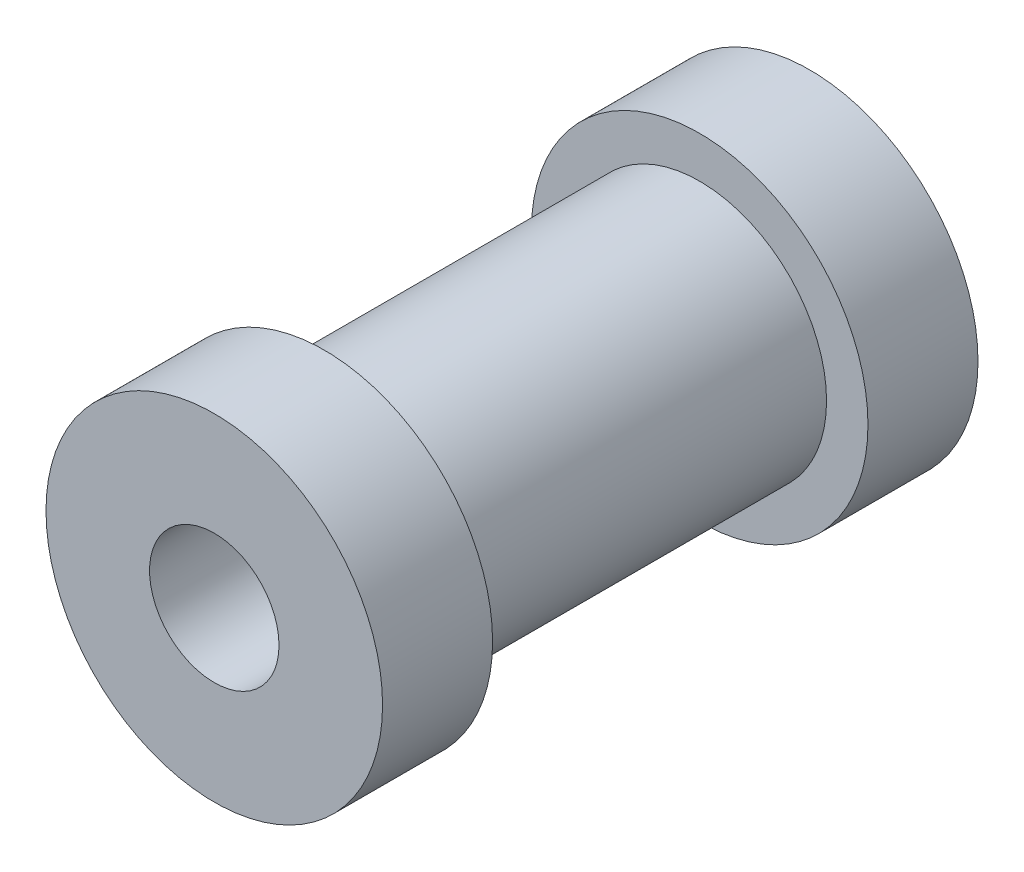
ISO-10303-21;
HEADER;
FILE_DESCRIPTION(('STEP AP214'),'2;1');
FILE_NAME('part.step','',(''),(''),'','','');
FILE_SCHEMA(('AUTOMOTIVE_DESIGN { 1 0 10303 214 1 1 1 1 }'));
ENDSEC;
DATA;
#1=APPLICATION_CONTEXT('core data for automotive mechanical design processes');
#2=APPLICATION_PROTOCOL_DEFINITION('international standard','automotive_design',2000,#1);
#3=PRODUCT_CONTEXT('',#1,'mechanical');
#4=PRODUCT('Part','Part','',(#3));
#5=PRODUCT_RELATED_PRODUCT_CATEGORY('part','',(#4));
#6=PRODUCT_DEFINITION_FORMATION('','',#4);
#7=PRODUCT_DEFINITION_CONTEXT('part definition',#1,'design');
#8=PRODUCT_DEFINITION('design','',#6,#7);
#9=PRODUCT_DEFINITION_SHAPE('','',#8);
#10=(LENGTH_UNIT() NAMED_UNIT(*) SI_UNIT(.MILLI.,.METRE.));
#11=(NAMED_UNIT(*) PLANE_ANGLE_UNIT() SI_UNIT($,.RADIAN.));
#12=(NAMED_UNIT(*) SI_UNIT($,.STERADIAN.) SOLID_ANGLE_UNIT());
#13=UNCERTAINTY_MEASURE_WITH_UNIT(LENGTH_MEASURE(1.E-05),#10,'distance_accuracy_value','');
#14=(GEOMETRIC_REPRESENTATION_CONTEXT(3) GLOBAL_UNCERTAINTY_ASSIGNED_CONTEXT((#13)) GLOBAL_UNIT_ASSIGNED_CONTEXT((#10,
#11,#12)) REPRESENTATION_CONTEXT('',''));
#15=CARTESIAN_POINT('',(0.,0.,0.));
#16=DIRECTION('',(0.,0.,1.));
#17=DIRECTION('',(1.,0.,0.));
#18=AXIS2_PLACEMENT_3D('',#15,#16,#17);
#19=CARTESIAN_POINT('',(0.,4.9,-18.75));
#20=DIRECTION('',(0.,0.,1.));
#21=DIRECTION('',(1.,0.,0.));
#22=AXIS2_PLACEMENT_3D('',#19,#20,#21);
#23=PLANE('',#22);
#24=CARTESIAN_POINT('',(0.,0.,-18.75));
#25=DIRECTION('',(0.,0.,-1.));
#26=DIRECTION('',(-1.,0.,0.));
#27=AXIS2_PLACEMENT_3D('',#24,#25,#26);
#28=CIRCLE('',#27,2.49999999999999);
#29=CARTESIAN_POINT('',(-2.49999999999999,0.,-18.75));
#30=VERTEX_POINT('',#29);
#31=EDGE_CURVE('E68',#30,#30,#28,.T.);
#32=ORIENTED_EDGE('',*,*,#31,.F.);
#33=EDGE_LOOP('',(#32));
#34=FACE_BOUND('',#33,.T.);
#35=CARTESIAN_POINT('',(0.,0.,-18.75));
#36=DIRECTION('',(0.,0.,1.));
#37=DIRECTION('',(1.,0.,0.));
#38=AXIS2_PLACEMENT_3D('',#35,#36,#37);
#39=CIRCLE('',#38,4.9);
#40=CARTESIAN_POINT('',(4.9,0.,-18.75));
#41=VERTEX_POINT('',#40);
#42=EDGE_CURVE('E60',#41,#41,#39,.T.);
#43=ORIENTED_EDGE('',*,*,#42,.F.);
#44=EDGE_LOOP('',(#43));
#45=FACE_BOUND('',#44,.T.);
#46=ADVANCED_FACE('F46',(#34,#45),#23,.F.);
#47=CARTESIAN_POINT('',(0.,0.,4.25));
#48=DIRECTION('',(0.,0.,-1.));
#49=DIRECTION('',(-1.,0.,0.));
#50=AXIS2_PLACEMENT_3D('',#47,#48,#49);
#51=PLANE('',#50);
#52=CARTESIAN_POINT('',(0.,0.,4.25));
#53=DIRECTION('',(0.,0.,1.));
#54=DIRECTION('',(1.,0.,0.));
#55=AXIS2_PLACEMENT_3D('',#52,#53,#54);
#56=CIRCLE('',#55,2.5);
#57=CARTESIAN_POINT('',(2.5,0.,4.25));
#58=VERTEX_POINT('',#57);
#59=EDGE_CURVE('E65',#58,#58,#56,.T.);
#60=ORIENTED_EDGE('',*,*,#59,.F.);
#61=EDGE_LOOP('',(#60));
#62=FACE_BOUND('',#61,.T.);
#63=CARTESIAN_POINT('',(0.,0.,4.24999999999998));
#64=DIRECTION('',(0.,0.,1.));
#65=DIRECTION('',(1.,0.,0.));
#66=AXIS2_PLACEMENT_3D('',#63,#64,#65);
#67=CIRCLE('',#66,6.5);
#68=CARTESIAN_POINT('',(6.5,0.,4.24999999999998));
#69=VERTEX_POINT('',#68);
#70=EDGE_CURVE('E11',#69,#69,#67,.T.);
#71=ORIENTED_EDGE('',*,*,#70,.T.);
#72=EDGE_LOOP('',(#71));
#73=FACE_BOUND('',#72,.T.);
#74=ADVANCED_FACE('F76',(#62,#73),#51,.F.);
#75=CARTESIAN_POINT('',(0.,0.,1000.));
#76=DIRECTION('',(0.,0.,1.));
#77=DIRECTION('',(1.,0.,0.));
#78=AXIS2_PLACEMENT_3D('',#75,#76,#77);
#79=CYLINDRICAL_SURFACE('',#78,6.5);
#80=ORIENTED_EDGE('',*,*,#70,.F.);
#81=EDGE_LOOP('',(#80));
#82=FACE_BOUND('',#81,.T.);
#83=CARTESIAN_POINT('',(0.,0.,0.));
#84=DIRECTION('',(0.,0.,1.));
#85=DIRECTION('',(1.,0.,0.));
#86=AXIS2_PLACEMENT_3D('',#83,#84,#85);
#87=CIRCLE('',#86,6.5);
#88=CARTESIAN_POINT('',(6.5,0.,0.));
#89=VERTEX_POINT('',#88);
#90=EDGE_CURVE('E52',#89,#89,#87,.T.);
#91=ORIENTED_EDGE('',*,*,#90,.T.);
#92=EDGE_LOOP('',(#91));
#93=FACE_BOUND('',#92,.T.);
#94=ADVANCED_FACE('F90',(#82,#93),#79,.T.);
#95=CARTESIAN_POINT('',(0.,6.5,0.));
#96=DIRECTION('',(0.,0.,1.));
#97=DIRECTION('',(1.,0.,0.));
#98=AXIS2_PLACEMENT_3D('',#95,#96,#97);
#99=PLANE('',#98);
#100=ORIENTED_EDGE('',*,*,#90,.F.);
#101=EDGE_LOOP('',(#100));
#102=FACE_BOUND('',#101,.T.);
#103=CARTESIAN_POINT('',(0.,0.,0.));
#104=DIRECTION('',(0.,0.,1.));
#105=DIRECTION('',(1.,0.,0.));
#106=AXIS2_PLACEMENT_3D('',#103,#104,#105);
#107=CIRCLE('',#106,4.9);
#108=CARTESIAN_POINT('',(4.9,0.,0.));
#109=VERTEX_POINT('',#108);
#110=EDGE_CURVE('E56',#109,#109,#107,.T.);
#111=ORIENTED_EDGE('',*,*,#110,.T.);
#112=EDGE_LOOP('',(#111));
#113=FACE_BOUND('',#112,.T.);
#114=ADVANCED_FACE('F81',(#102,#113),#99,.F.);
#115=CARTESIAN_POINT('',(0.,0.,1000.));
#116=DIRECTION('',(0.,0.,1.));
#117=DIRECTION('',(1.,0.,0.));
#118=AXIS2_PLACEMENT_3D('',#115,#116,#117);
#119=CYLINDRICAL_SURFACE('',#118,4.9);
#120=ORIENTED_EDGE('',*,*,#110,.F.);
#121=EDGE_LOOP('',(#120));
#122=FACE_BOUND('',#121,.T.);
#123=ORIENTED_EDGE('',*,*,#42,.T.);
#124=EDGE_LOOP('',(#123));
#125=FACE_BOUND('',#124,.T.);
#126=ADVANCED_FACE('F79',(#122,#125),#119,.T.);
#127=CARTESIAN_POINT('',(0.,0.,4.25));
#128=DIRECTION('',(0.,0.,1.));
#129=DIRECTION('',(1.,0.,0.));
#130=AXIS2_PLACEMENT_3D('',#127,#128,#129);
#131=CYLINDRICAL_SURFACE('',#130,2.5);
#132=ORIENTED_EDGE('',*,*,#59,.T.);
#133=EDGE_LOOP('',(#132));
#134=FACE_BOUND('',#133,.T.);
#135=ORIENTED_EDGE('',*,*,#31,.T.);
#136=EDGE_LOOP('',(#135));
#137=FACE_BOUND('',#136,.T.);
#138=ADVANCED_FACE('F72',(#134,#137),#131,.F.);
#139=CLOSED_SHELL('',(#46,#74,#94,#114,#126,#138));
#140=MANIFOLD_SOLID_BREP('B2',#139);
#141=CARTESIAN_POINT('',(0.,6.5,-18.75));
#142=DIRECTION('',(0.,0.,1.));
#143=DIRECTION('',(1.,0.,0.));
#144=AXIS2_PLACEMENT_3D('',#141,#142,#143);
#145=PLANE('',#144);
#146=CARTESIAN_POINT('',(0.,0.,-18.75));
#147=DIRECTION('',(0.,0.,1.));
#148=DIRECTION('',(1.,0.,0.));
#149=AXIS2_PLACEMENT_3D('',#146,#147,#148);
#150=CIRCLE('',#149,6.5);
#151=CARTESIAN_POINT('',(6.5,0.,-18.75));
#152=VERTEX_POINT('',#151);
#153=EDGE_CURVE('E158',#152,#152,#150,.T.);
#154=ORIENTED_EDGE('',*,*,#153,.F.);
#155=EDGE_LOOP('',(#154));
#156=FACE_BOUND('',#155,.T.);
#157=CARTESIAN_POINT('',(0.,0.,-18.75));
#158=DIRECTION('',(0.,0.,1.));
#159=DIRECTION('',(1.,0.,0.));
#160=AXIS2_PLACEMENT_3D('',#157,#158,#159);
#161=CIRCLE('',#160,4.9);
#162=CARTESIAN_POINT('',(4.9,0.,-18.75));
#163=VERTEX_POINT('',#162);
#164=EDGE_CURVE('E45',#163,#163,#161,.T.);
#165=ORIENTED_EDGE('',*,*,#164,.T.);
#166=EDGE_LOOP('',(#165));
#167=FACE_BOUND('',#166,.T.);
#168=ADVANCED_FACE('F144',(#156,#167),#145,.F.);
#169=CARTESIAN_POINT('',(0.,0.,1000.));
#170=DIRECTION('',(0.,0.,1.));
#171=DIRECTION('',(1.,0.,0.));
#172=AXIS2_PLACEMENT_3D('',#169,#170,#171);
#173=CYLINDRICAL_SURFACE('',#172,4.9);
#174=ORIENTED_EDGE('',*,*,#164,.F.);
#175=EDGE_LOOP('',(#174));
#176=FACE_BOUND('',#175,.T.);
#177=CARTESIAN_POINT('',(0.,0.,-14.5));
#178=DIRECTION('',(0.,0.,1.));
#179=DIRECTION('',(1.,0.,0.));
#180=AXIS2_PLACEMENT_3D('',#177,#178,#179);
#181=CIRCLE('',#180,4.9);
#182=CARTESIAN_POINT('',(4.9,0.,-14.5));
#183=VERTEX_POINT('',#182);
#184=EDGE_CURVE('E150',#183,#183,#181,.T.);
#185=ORIENTED_EDGE('',*,*,#184,.T.);
#186=EDGE_LOOP('',(#185));
#187=FACE_BOUND('',#186,.T.);
#188=ADVANCED_FACE('F167',(#176,#187),#173,.F.);
#189=CARTESIAN_POINT('',(0.,6.5,-14.5));
#190=DIRECTION('',(0.,0.,-1.));
#191=DIRECTION('',(-1.,0.,0.));
#192=AXIS2_PLACEMENT_3D('',#189,#190,#191);
#193=PLANE('',#192);
#194=ORIENTED_EDGE('',*,*,#184,.F.);
#195=EDGE_LOOP('',(#194));
#196=FACE_BOUND('',#195,.T.);
#197=CARTESIAN_POINT('',(0.,0.,-14.5));
#198=DIRECTION('',(0.,0.,1.));
#199=DIRECTION('',(1.,0.,0.));
#200=AXIS2_PLACEMENT_3D('',#197,#198,#199);
#201=CIRCLE('',#200,6.5);
#202=CARTESIAN_POINT('',(6.5,0.,-14.5));
#203=VERTEX_POINT('',#202);
#204=EDGE_CURVE('E154',#203,#203,#201,.T.);
#205=ORIENTED_EDGE('',*,*,#204,.T.);
#206=EDGE_LOOP('',(#205));
#207=FACE_BOUND('',#206,.T.);
#208=ADVANCED_FACE('F171',(#196,#207),#193,.F.);
#209=CARTESIAN_POINT('',(0.,0.,1000.));
#210=DIRECTION('',(0.,0.,1.));
#211=DIRECTION('',(1.,0.,0.));
#212=AXIS2_PLACEMENT_3D('',#209,#210,#211);
#213=CYLINDRICAL_SURFACE('',#212,6.5);
#214=ORIENTED_EDGE('',*,*,#204,.F.);
#215=EDGE_LOOP('',(#214));
#216=FACE_BOUND('',#215,.T.);
#217=ORIENTED_EDGE('',*,*,#153,.T.);
#218=EDGE_LOOP('',(#217));
#219=FACE_BOUND('',#218,.T.);
#220=ADVANCED_FACE('F164',(#216,#219),#213,.T.);
#221=CLOSED_SHELL('',(#168,#188,#208,#220));
#222=MANIFOLD_SOLID_BREP('B6',#221);
#223=ADVANCED_BREP_SHAPE_REPRESENTATION('',(#18,#140,#222),#14);
#224=SHAPE_DEFINITION_REPRESENTATION(#9,#223);
ENDSEC;
END-ISO-10303-21;
